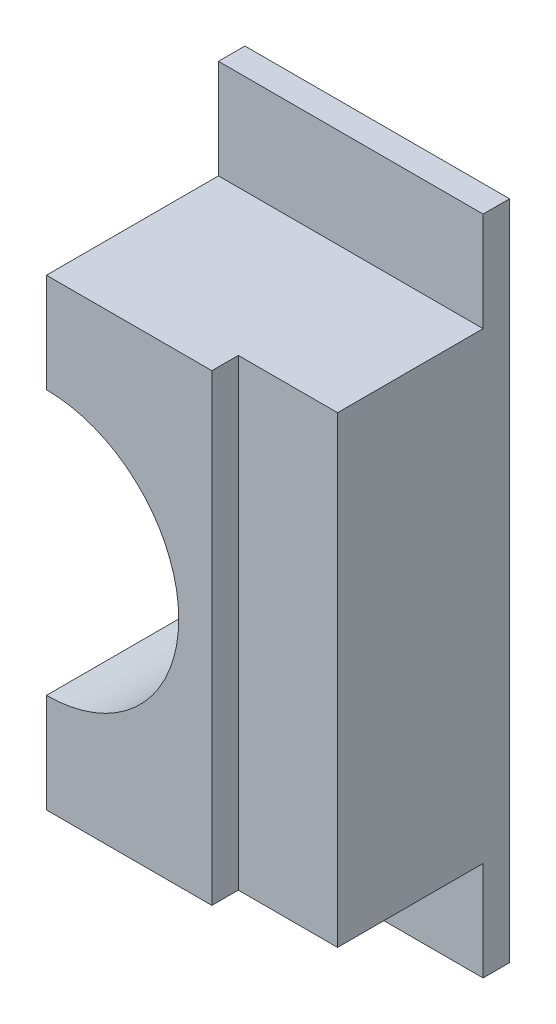
ISO-10303-21;
HEADER;
FILE_DESCRIPTION(('STEP AP214'),'2;1');
FILE_NAME('part.step','',(''),(''),'','','');
FILE_SCHEMA(('AUTOMOTIVE_DESIGN { 1 0 10303 214 1 1 1 1 }'));
ENDSEC;
DATA;
#1=APPLICATION_CONTEXT('core data for automotive mechanical design processes');
#2=APPLICATION_PROTOCOL_DEFINITION('international standard','automotive_design',2000,#1);
#3=PRODUCT_CONTEXT('',#1,'mechanical');
#4=PRODUCT('Part','Part','',(#3));
#5=PRODUCT_RELATED_PRODUCT_CATEGORY('part','',(#4));
#6=PRODUCT_DEFINITION_FORMATION('','',#4);
#7=PRODUCT_DEFINITION_CONTEXT('part definition',#1,'design');
#8=PRODUCT_DEFINITION('design','',#6,#7);
#9=PRODUCT_DEFINITION_SHAPE('','',#8);
#10=(LENGTH_UNIT() NAMED_UNIT(*) SI_UNIT(.MILLI.,.METRE.));
#11=(NAMED_UNIT(*) PLANE_ANGLE_UNIT() SI_UNIT($,.RADIAN.));
#12=(NAMED_UNIT(*) SI_UNIT($,.STERADIAN.) SOLID_ANGLE_UNIT());
#13=UNCERTAINTY_MEASURE_WITH_UNIT(LENGTH_MEASURE(1.E-05),#10,'distance_accuracy_value','');
#14=(GEOMETRIC_REPRESENTATION_CONTEXT(3) GLOBAL_UNCERTAINTY_ASSIGNED_CONTEXT((#13)) GLOBAL_UNIT_ASSIGNED_CONTEXT((#10,
#11,#12)) REPRESENTATION_CONTEXT('',''));
#15=CARTESIAN_POINT('',(0.,0.,0.));
#16=DIRECTION('',(0.,0.,1.));
#17=DIRECTION('',(1.,0.,0.));
#18=AXIS2_PLACEMENT_3D('',#15,#16,#17);
#19=CARTESIAN_POINT('',(0.8,0.,0.26));
#20=DIRECTION('',(0.,0.,1.));
#21=DIRECTION('',(0.,-1.,0.));
#22=AXIS2_PLACEMENT_3D('',#19,#20,#21);
#23=PLANE('',#22);
#24=DIRECTION('',(1.,0.,0.));
#25=VECTOR('',#24,1.);
#26=CARTESIAN_POINT('',(-0.2,-0.35,0.26));
#27=LINE('',#26,#25);
#28=CARTESIAN_POINT('',(0.05,-0.35,0.26));
#29=VERTEX_POINT('',#28);
#30=CARTESIAN_POINT('',(0.2,-0.35,0.26));
#31=VERTEX_POINT('',#30);
#32=EDGE_CURVE('E27',#29,#31,#27,.T.);
#33=ORIENTED_EDGE('',*,*,#32,.T.);
#34=DIRECTION('',(0.,1.,0.));
#35=VECTOR('',#34,1.);
#36=CARTESIAN_POINT('',(0.2,-0.625,0.26));
#37=LINE('',#36,#35);
#38=CARTESIAN_POINT('',(0.2,0.35,0.26));
#39=VERTEX_POINT('',#38);
#40=EDGE_CURVE('E139',#31,#39,#37,.T.);
#41=ORIENTED_EDGE('',*,*,#40,.T.);
#42=DIRECTION('',(-1.,0.,0.));
#43=VECTOR('',#42,1.);
#44=CARTESIAN_POINT('',(0.2,0.35,0.26));
#45=LINE('',#44,#43);
#46=CARTESIAN_POINT('',(0.05,0.35,0.26));
#47=VERTEX_POINT('',#46);
#48=EDGE_CURVE('E11',#39,#47,#45,.T.);
#49=ORIENTED_EDGE('',*,*,#48,.T.);
#50=DIRECTION('',(0.,-1.,0.));
#51=VECTOR('',#50,1.);
#52=CARTESIAN_POINT('',(0.05,0.625,0.26));
#53=LINE('',#52,#51);
#54=EDGE_CURVE('E136',#47,#29,#53,.T.);
#55=ORIENTED_EDGE('',*,*,#54,.T.);
#56=EDGE_LOOP('',(#33,#41,#49,#55));
#57=FACE_BOUND('',#56,.T.);
#58=ADVANCED_FACE('F16',(#57),#23,.T.);
#59=CARTESIAN_POINT('',(0.2,0.35,0.3));
#60=DIRECTION('',(0.,-1.,0.));
#61=DIRECTION('',(0.,0.,-1.));
#62=AXIS2_PLACEMENT_3D('',#59,#60,#61);
#63=PLANE('',#62);
#64=ORIENTED_EDGE('',*,*,#48,.F.);
#65=DIRECTION('',(0.,0.,-1.));
#66=VECTOR('',#65,1.);
#67=CARTESIAN_POINT('',(0.2,0.35,0.3));
#68=LINE('',#67,#66);
#69=CARTESIAN_POINT('',(0.2,0.35,0.04));
#70=VERTEX_POINT('',#69);
#71=EDGE_CURVE('E170',#39,#70,#68,.T.);
#72=ORIENTED_EDGE('',*,*,#71,.T.);
#73=DIRECTION('',(-1.,0.,0.));
#74=VECTOR('',#73,1.);
#75=CARTESIAN_POINT('',(0.2,0.35,0.04));
#76=LINE('',#75,#74);
#77=CARTESIAN_POINT('',(-0.2,0.35,0.04));
#78=VERTEX_POINT('',#77);
#79=EDGE_CURVE('E203',#70,#78,#76,.T.);
#80=ORIENTED_EDGE('',*,*,#79,.T.);
#81=DIRECTION('',(0.,0.,-1.));
#82=VECTOR('',#81,1.);
#83=CARTESIAN_POINT('',(-0.2,0.35,0.3));
#84=LINE('',#83,#82);
#85=CARTESIAN_POINT('',(-0.2,0.35,0.3));
#86=VERTEX_POINT('',#85);
#87=EDGE_CURVE('E246',#86,#78,#84,.T.);
#88=ORIENTED_EDGE('',*,*,#87,.F.);
#89=DIRECTION('',(-1.,0.,0.));
#90=VECTOR('',#89,1.);
#91=CARTESIAN_POINT('',(0.2,0.35,0.3));
#92=LINE('',#91,#90);
#93=CARTESIAN_POINT('',(0.05,0.35,0.3));
#94=VERTEX_POINT('',#93);
#95=EDGE_CURVE('E156',#94,#86,#92,.T.);
#96=ORIENTED_EDGE('',*,*,#95,.F.);
#97=DIRECTION('',(0.,0.,1.));
#98=VECTOR('',#97,1.);
#99=CARTESIAN_POINT('',(0.05,0.35,0.3));
#100=LINE('',#99,#98);
#101=EDGE_CURVE('E148',#47,#94,#100,.T.);
#102=ORIENTED_EDGE('',*,*,#101,.F.);
#103=EDGE_LOOP('',(#64,#72,#80,#88,#96,#102));
#104=FACE_BOUND('',#103,.T.);
#105=ADVANCED_FACE('F153',(#104),#63,.F.);
#106=CARTESIAN_POINT('',(-0.2,-0.35,0.3));
#107=DIRECTION('',(0.,1.,0.));
#108=DIRECTION('',(1.,0.,0.));
#109=AXIS2_PLACEMENT_3D('',#106,#107,#108);
#110=PLANE('',#109);
#111=DIRECTION('',(0.,0.,-1.));
#112=VECTOR('',#111,1.);
#113=CARTESIAN_POINT('',(0.05,-0.35,0.3));
#114=LINE('',#113,#112);
#115=CARTESIAN_POINT('',(0.05,-0.35,0.3));
#116=VERTEX_POINT('',#115);
#117=EDGE_CURVE('E149',#116,#29,#114,.T.);
#118=ORIENTED_EDGE('',*,*,#117,.F.);
#119=DIRECTION('',(1.,0.,0.));
#120=VECTOR('',#119,1.);
#121=CARTESIAN_POINT('',(-0.2,-0.35,0.3));
#122=LINE('',#121,#120);
#123=CARTESIAN_POINT('',(-0.2,-0.35,0.3));
#124=VERTEX_POINT('',#123);
#125=EDGE_CURVE('E41',#124,#116,#122,.T.);
#126=ORIENTED_EDGE('',*,*,#125,.F.);
#127=DIRECTION('',(0.,0.,-1.));
#128=VECTOR('',#127,1.);
#129=CARTESIAN_POINT('',(-0.2,-0.35,0.3));
#130=LINE('',#129,#128);
#131=CARTESIAN_POINT('',(-0.2,-0.35,0.04));
#132=VERTEX_POINT('',#131);
#133=EDGE_CURVE('E250',#124,#132,#130,.T.);
#134=ORIENTED_EDGE('',*,*,#133,.T.);
#135=DIRECTION('',(1.,0.,0.));
#136=VECTOR('',#135,1.);
#137=CARTESIAN_POINT('',(-0.2,-0.35,0.04));
#138=LINE('',#137,#136);
#139=CARTESIAN_POINT('',(0.2,-0.35,0.04));
#140=VERTEX_POINT('',#139);
#141=EDGE_CURVE('E173',#132,#140,#138,.T.);
#142=ORIENTED_EDGE('',*,*,#141,.T.);
#143=DIRECTION('',(0.,0.,-1.));
#144=VECTOR('',#143,1.);
#145=CARTESIAN_POINT('',(0.2,-0.35,0.3));
#146=LINE('',#145,#144);
#147=EDGE_CURVE('E20',#31,#140,#146,.T.);
#148=ORIENTED_EDGE('',*,*,#147,.F.);
#149=ORIENTED_EDGE('',*,*,#32,.F.);
#150=EDGE_LOOP('',(#118,#126,#134,#142,#148,#149));
#151=FACE_BOUND('',#150,.T.);
#152=ADVANCED_FACE('F299',(#151),#110,.F.);
#153=CARTESIAN_POINT('',(-0.2,-0.35,0.3));
#154=DIRECTION('',(0.,0.,1.));
#155=DIRECTION('',(1.,0.,0.));
#156=AXIS2_PLACEMENT_3D('',#153,#154,#155);
#157=PLANE('',#156);
#158=DIRECTION('',(0.,-1.,0.));
#159=VECTOR('',#158,1.);
#160=CARTESIAN_POINT('',(0.05,0.625,0.3));
#161=LINE('',#160,#159);
#162=EDGE_CURVE('E159',#94,#116,#161,.T.);
#163=ORIENTED_EDGE('',*,*,#162,.F.);
#164=ORIENTED_EDGE('',*,*,#95,.T.);
#165=DIRECTION('',(0.,-1.,0.));
#166=VECTOR('',#165,1.);
#167=CARTESIAN_POINT('',(-0.2,0.35,0.3));
#168=LINE('',#167,#166);
#169=CARTESIAN_POINT('',(-0.2,0.2,0.3));
#170=VERTEX_POINT('',#169);
#171=EDGE_CURVE('E238',#86,#170,#168,.T.);
#172=ORIENTED_EDGE('',*,*,#171,.T.);
#173=CARTESIAN_POINT('',(-0.2,0.,0.3));
#174=DIRECTION('',(0.,0.,1.));
#175=DIRECTION('',(1.,0.,0.));
#176=AXIS2_PLACEMENT_3D('',#173,#174,#175);
#177=CIRCLE('',#176,0.2);
#178=CARTESIAN_POINT('',(-0.2,-0.2,0.3));
#179=VERTEX_POINT('',#178);
#180=EDGE_CURVE('E151',#179,#170,#177,.T.);
#181=ORIENTED_EDGE('',*,*,#180,.F.);
#182=DIRECTION('',(0.,-1.,0.));
#183=VECTOR('',#182,1.);
#184=CARTESIAN_POINT('',(-0.2,0.35,0.3));
#185=LINE('',#184,#183);
#186=EDGE_CURVE('E201',#179,#124,#185,.T.);
#187=ORIENTED_EDGE('',*,*,#186,.T.);
#188=ORIENTED_EDGE('',*,*,#125,.T.);
#189=EDGE_LOOP('',(#163,#164,#172,#181,#187,#188));
#190=FACE_BOUND('',#189,.T.);
#191=ADVANCED_FACE('F285',(#190),#157,.T.);
#192=CARTESIAN_POINT('',(-0.2,0.35,0.3));
#193=DIRECTION('',(1.,0.,0.));
#194=DIRECTION('',(0.,1.,0.));
#195=AXIS2_PLACEMENT_3D('',#192,#193,#194);
#196=PLANE('',#195);
#197=ORIENTED_EDGE('',*,*,#186,.F.);
#198=DIRECTION('',(0.,0.,-1.));
#199=VECTOR('',#198,1.);
#200=CARTESIAN_POINT('',(-0.2,-0.2,1.204159457879));
#201=LINE('',#200,#199);
#202=CARTESIAN_POINT('',(-0.2,-0.2,0.));
#203=VERTEX_POINT('',#202);
#204=EDGE_CURVE('E208',#179,#203,#201,.T.);
#205=ORIENTED_EDGE('',*,*,#204,.T.);
#206=DIRECTION('',(0.,-1.,0.));
#207=VECTOR('',#206,1.);
#208=CARTESIAN_POINT('',(-0.2,0.35,0.));
#209=LINE('',#208,#207);
#210=CARTESIAN_POINT('',(-0.2,-0.5,0.));
#211=VERTEX_POINT('',#210);
#212=EDGE_CURVE('E192',#203,#211,#209,.T.);
#213=ORIENTED_EDGE('',*,*,#212,.T.);
#214=DIRECTION('',(0.,0.,-1.));
#215=VECTOR('',#214,1.);
#216=CARTESIAN_POINT('',(-0.2,-0.5,0.04));
#217=LINE('',#216,#215);
#218=CARTESIAN_POINT('',(-0.2,-0.5,0.04));
#219=VERTEX_POINT('',#218);
#220=EDGE_CURVE('E101',#219,#211,#217,.T.);
#221=ORIENTED_EDGE('',*,*,#220,.F.);
#222=DIRECTION('',(0.,-1.,0.));
#223=VECTOR('',#222,1.);
#224=CARTESIAN_POINT('',(-0.2,0.5,0.04));
#225=LINE('',#224,#223);
#226=EDGE_CURVE('E199',#132,#219,#225,.T.);
#227=ORIENTED_EDGE('',*,*,#226,.F.);
#228=ORIENTED_EDGE('',*,*,#133,.F.);
#229=EDGE_LOOP('',(#197,#205,#213,#221,#227,#228));
#230=FACE_BOUND('',#229,.T.);
#231=ADVANCED_FACE('F18',(#230),#196,.F.);
#232=CARTESIAN_POINT('',(-0.2,-0.5,0.04));
#233=DIRECTION('',(0.,0.,1.));
#234=DIRECTION('',(1.,0.,0.));
#235=AXIS2_PLACEMENT_3D('',#232,#233,#234);
#236=PLANE('',#235);
#237=ORIENTED_EDGE('',*,*,#141,.F.);
#238=ORIENTED_EDGE('',*,*,#226,.T.);
#239=DIRECTION('',(1.,0.,0.));
#240=VECTOR('',#239,1.);
#241=CARTESIAN_POINT('',(-0.2,-0.5,0.04));
#242=LINE('',#241,#240);
#243=CARTESIAN_POINT('',(0.2,-0.5,0.04));
#244=VERTEX_POINT('',#243);
#245=EDGE_CURVE('E184',#219,#244,#242,.T.);
#246=ORIENTED_EDGE('',*,*,#245,.T.);
#247=DIRECTION('',(0.,1.,0.));
#248=VECTOR('',#247,1.);
#249=CARTESIAN_POINT('',(0.2,-0.5,0.04));
#250=LINE('',#249,#248);
#251=EDGE_CURVE('E174',#244,#140,#250,.T.);
#252=ORIENTED_EDGE('',*,*,#251,.T.);
#253=EDGE_LOOP('',(#237,#238,#246,#252));
#254=FACE_BOUND('',#253,.T.);
#255=ADVANCED_FACE('F296',(#254),#236,.T.);
#256=CARTESIAN_POINT('',(0.2,-0.35,0.3));
#257=DIRECTION('',(-1.,0.,0.));
#258=DIRECTION('',(0.,0.,1.));
#259=AXIS2_PLACEMENT_3D('',#256,#257,#258);
#260=PLANE('',#259);
#261=ORIENTED_EDGE('',*,*,#40,.F.);
#262=ORIENTED_EDGE('',*,*,#147,.T.);
#263=ORIENTED_EDGE('',*,*,#251,.F.);
#264=DIRECTION('',(0.,0.,-1.));
#265=VECTOR('',#264,1.);
#266=CARTESIAN_POINT('',(0.2,-0.5,0.04));
#267=LINE('',#266,#265);
#268=CARTESIAN_POINT('',(0.2,-0.5,0.));
#269=VERTEX_POINT('',#268);
#270=EDGE_CURVE('E112',#244,#269,#267,.T.);
#271=ORIENTED_EDGE('',*,*,#270,.T.);
#272=DIRECTION('',(0.,1.,0.));
#273=VECTOR('',#272,1.);
#274=CARTESIAN_POINT('',(0.2,-0.35,0.));
#275=LINE('',#274,#273);
#276=CARTESIAN_POINT('',(0.2,0.5,0.));
#277=VERTEX_POINT('',#276);
#278=EDGE_CURVE('E178',#269,#277,#275,.T.);
#279=ORIENTED_EDGE('',*,*,#278,.T.);
#280=DIRECTION('',(0.,0.,-1.));
#281=VECTOR('',#280,1.);
#282=CARTESIAN_POINT('',(0.2,0.5,0.04));
#283=LINE('',#282,#281);
#284=CARTESIAN_POINT('',(0.2,0.5,0.04));
#285=VERTEX_POINT('',#284);
#286=EDGE_CURVE('E220',#285,#277,#283,.T.);
#287=ORIENTED_EDGE('',*,*,#286,.F.);
#288=DIRECTION('',(0.,1.,0.));
#289=VECTOR('',#288,1.);
#290=CARTESIAN_POINT('',(0.2,-0.5,0.04));
#291=LINE('',#290,#289);
#292=EDGE_CURVE('E206',#70,#285,#291,.T.);
#293=ORIENTED_EDGE('',*,*,#292,.F.);
#294=ORIENTED_EDGE('',*,*,#71,.F.);
#295=EDGE_LOOP('',(#261,#262,#263,#271,#279,#287,#293,#294));
#296=FACE_BOUND('',#295,.T.);
#297=ADVANCED_FACE('F322',(#296),#260,.F.);
#298=CARTESIAN_POINT('',(-0.2,-0.5,0.04));
#299=DIRECTION('',(0.,0.,1.));
#300=DIRECTION('',(1.,0.,0.));
#301=AXIS2_PLACEMENT_3D('',#298,#299,#300);
#302=PLANE('',#301);
#303=ORIENTED_EDGE('',*,*,#79,.F.);
#304=ORIENTED_EDGE('',*,*,#292,.T.);
#305=DIRECTION('',(-1.,0.,0.));
#306=VECTOR('',#305,1.);
#307=CARTESIAN_POINT('',(0.2,0.5,0.04));
#308=LINE('',#307,#306);
#309=CARTESIAN_POINT('',(-0.2,0.5,0.04));
#310=VERTEX_POINT('',#309);
#311=EDGE_CURVE('E223',#285,#310,#308,.T.);
#312=ORIENTED_EDGE('',*,*,#311,.T.);
#313=DIRECTION('',(0.,-1.,0.));
#314=VECTOR('',#313,1.);
#315=CARTESIAN_POINT('',(-0.2,0.5,0.04));
#316=LINE('',#315,#314);
#317=EDGE_CURVE('E207',#310,#78,#316,.T.);
#318=ORIENTED_EDGE('',*,*,#317,.T.);
#319=EDGE_LOOP('',(#303,#304,#312,#318));
#320=FACE_BOUND('',#319,.T.);
#321=ADVANCED_FACE('F317',(#320),#302,.T.);
#322=CARTESIAN_POINT('',(-0.2,0.35,0.3));
#323=DIRECTION('',(1.,0.,0.));
#324=DIRECTION('',(0.,1.,0.));
#325=AXIS2_PLACEMENT_3D('',#322,#323,#324);
#326=PLANE('',#325);
#327=DIRECTION('',(0.,-1.,0.));
#328=VECTOR('',#327,1.);
#329=CARTESIAN_POINT('',(-0.2,0.35,0.));
#330=LINE('',#329,#328);
#331=CARTESIAN_POINT('',(-0.2,0.5,0.));
#332=VERTEX_POINT('',#331);
#333=CARTESIAN_POINT('',(-0.2,0.2,0.));
#334=VERTEX_POINT('',#333);
#335=EDGE_CURVE('E168',#332,#334,#330,.T.);
#336=ORIENTED_EDGE('',*,*,#335,.T.);
#337=DIRECTION('',(0.,0.,-1.));
#338=VECTOR('',#337,1.);
#339=CARTESIAN_POINT('',(-0.2,0.2,1.204159457879));
#340=LINE('',#339,#338);
#341=EDGE_CURVE('E219',#170,#334,#340,.T.);
#342=ORIENTED_EDGE('',*,*,#341,.F.);
#343=ORIENTED_EDGE('',*,*,#171,.F.);
#344=ORIENTED_EDGE('',*,*,#87,.T.);
#345=ORIENTED_EDGE('',*,*,#317,.F.);
#346=DIRECTION('',(0.,0.,-1.));
#347=VECTOR('',#346,1.);
#348=CARTESIAN_POINT('',(-0.2,0.5,0.04));
#349=LINE('',#348,#347);
#350=EDGE_CURVE('E232',#310,#332,#349,.T.);
#351=ORIENTED_EDGE('',*,*,#350,.T.);
#352=EDGE_LOOP('',(#336,#342,#343,#344,#345,#351));
#353=FACE_BOUND('',#352,.T.);
#354=ADVANCED_FACE('F288',(#353),#326,.F.);
#355=CARTESIAN_POINT('',(-0.2,-0.5,0.04));
#356=DIRECTION('',(0.,1.,0.));
#357=DIRECTION('',(1.,0.,0.));
#358=AXIS2_PLACEMENT_3D('',#355,#356,#357);
#359=PLANE('',#358);
#360=DIRECTION('',(1.,0.,0.));
#361=VECTOR('',#360,1.);
#362=CARTESIAN_POINT('',(-0.2,-0.5,0.));
#363=LINE('',#362,#361);
#364=EDGE_CURVE('E176',#211,#269,#363,.T.);
#365=ORIENTED_EDGE('',*,*,#364,.T.);
#366=ORIENTED_EDGE('',*,*,#270,.F.);
#367=ORIENTED_EDGE('',*,*,#245,.F.);
#368=ORIENTED_EDGE('',*,*,#220,.T.);
#369=EDGE_LOOP('',(#365,#366,#367,#368));
#370=FACE_BOUND('',#369,.T.);
#371=ADVANCED_FACE('F370',(#370),#359,.F.);
#372=CARTESIAN_POINT('',(-0.2,-0.35,0.));
#373=DIRECTION('',(0.,0.,1.));
#374=DIRECTION('',(1.,0.,0.));
#375=AXIS2_PLACEMENT_3D('',#372,#373,#374);
#376=PLANE('',#375);
#377=ORIENTED_EDGE('',*,*,#212,.F.);
#378=CARTESIAN_POINT('',(-0.2,0.,0.));
#379=DIRECTION('',(0.,0.,1.));
#380=DIRECTION('',(1.,0.,0.));
#381=AXIS2_PLACEMENT_3D('',#378,#379,#380);
#382=CIRCLE('',#381,0.2);
#383=EDGE_CURVE('E213',#203,#334,#382,.T.);
#384=ORIENTED_EDGE('',*,*,#383,.T.);
#385=ORIENTED_EDGE('',*,*,#335,.F.);
#386=DIRECTION('',(-1.,0.,0.));
#387=VECTOR('',#386,1.);
#388=CARTESIAN_POINT('',(0.2,0.5,0.));
#389=LINE('',#388,#387);
#390=EDGE_CURVE('E212',#277,#332,#389,.T.);
#391=ORIENTED_EDGE('',*,*,#390,.F.);
#392=ORIENTED_EDGE('',*,*,#278,.F.);
#393=ORIENTED_EDGE('',*,*,#364,.F.);
#394=EDGE_LOOP('',(#377,#384,#385,#391,#392,#393));
#395=FACE_BOUND('',#394,.T.);
#396=ADVANCED_FACE('F292',(#395),#376,.F.);
#397=CARTESIAN_POINT('',(0.2,0.5,0.04));
#398=DIRECTION('',(0.,-1.,0.));
#399=DIRECTION('',(0.,0.,-1.));
#400=AXIS2_PLACEMENT_3D('',#397,#398,#399);
#401=PLANE('',#400);
#402=ORIENTED_EDGE('',*,*,#390,.T.);
#403=ORIENTED_EDGE('',*,*,#350,.F.);
#404=ORIENTED_EDGE('',*,*,#311,.F.);
#405=ORIENTED_EDGE('',*,*,#286,.T.);
#406=EDGE_LOOP('',(#402,#403,#404,#405));
#407=FACE_BOUND('',#406,.T.);
#408=ADVANCED_FACE('F353',(#407),#401,.F.);
#409=CARTESIAN_POINT('',(-0.2,0.,1.204159457879));
#410=DIRECTION('',(0.,0.,-1.));
#411=DIRECTION('',(-1.,0.,0.));
#412=AXIS2_PLACEMENT_3D('',#409,#410,#411);
#413=CYLINDRICAL_SURFACE('',#412,0.2);
#414=ORIENTED_EDGE('',*,*,#180,.T.);
#415=ORIENTED_EDGE('',*,*,#341,.T.);
#416=ORIENTED_EDGE('',*,*,#383,.F.);
#417=ORIENTED_EDGE('',*,*,#204,.F.);
#418=EDGE_LOOP('',(#414,#415,#416,#417));
#419=FACE_BOUND('',#418,.T.);
#420=ADVANCED_FACE('F282',(#419),#413,.F.);
#421=CARTESIAN_POINT('',(0.05,0.625,0.3));
#422=DIRECTION('',(1.,0.,0.));
#423=DIRECTION('',(0.,1.,0.));
#424=AXIS2_PLACEMENT_3D('',#421,#422,#423);
#425=PLANE('',#424);
#426=ORIENTED_EDGE('',*,*,#101,.T.);
#427=ORIENTED_EDGE('',*,*,#162,.T.);
#428=ORIENTED_EDGE('',*,*,#117,.T.);
#429=ORIENTED_EDGE('',*,*,#54,.F.);
#430=EDGE_LOOP('',(#426,#427,#428,#429));
#431=FACE_BOUND('',#430,.T.);
#432=ADVANCED_FACE('F146',(#431),#425,.T.);
#433=CLOSED_SHELL('',(#58,#105,#152,#191,#231,#255,#297,#321,#354,#371,#396,#408,#420,#432));
#434=MANIFOLD_SOLID_BREP('B1',#433);
#435=ADVANCED_BREP_SHAPE_REPRESENTATION('',(#18,#434),#14);
#436=SHAPE_DEFINITION_REPRESENTATION(#9,#435);
ENDSEC;
END-ISO-10303-21;
